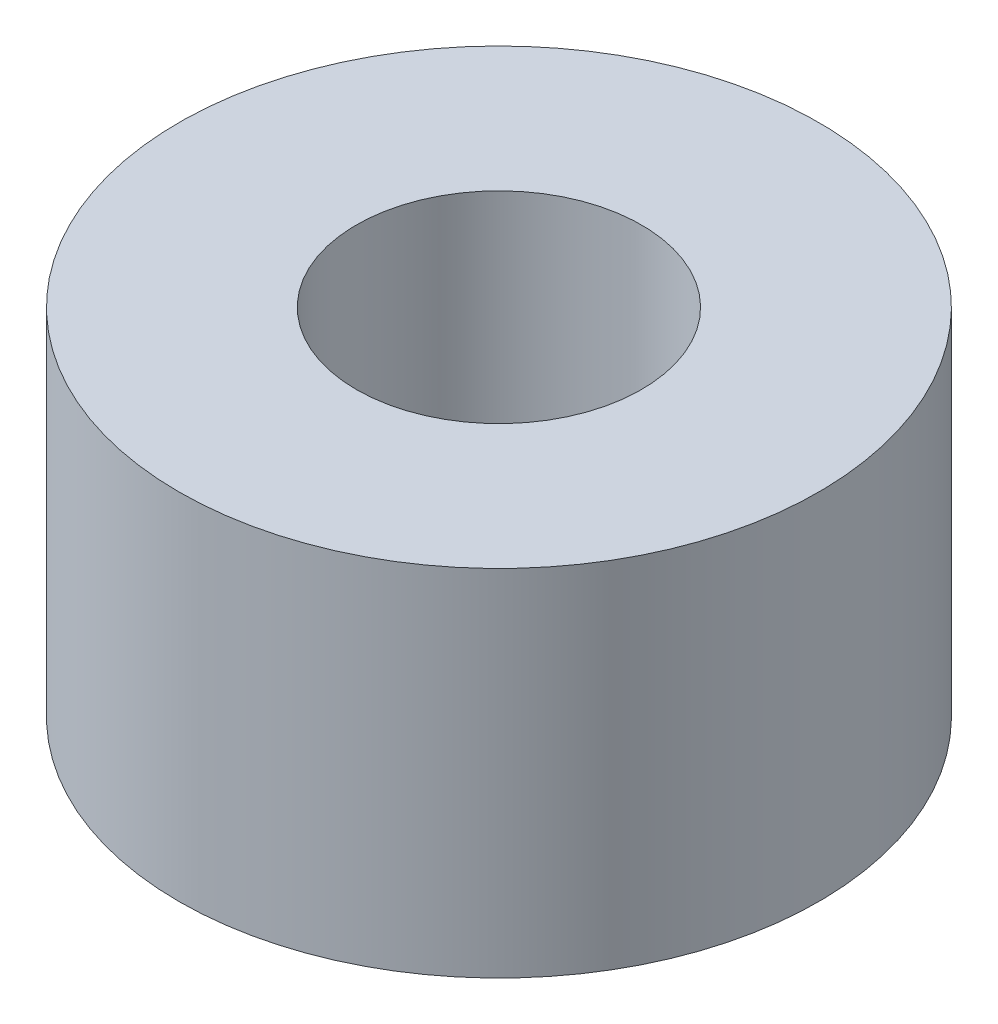
ISO-10303-21;
HEADER;
FILE_DESCRIPTION(('STEP AP214'),'2;1');
FILE_NAME('part.step','',(''),(''),'','','');
FILE_SCHEMA(('AUTOMOTIVE_DESIGN { 1 0 10303 214 1 1 1 1 }'));
ENDSEC;
DATA;
#1=APPLICATION_CONTEXT('core data for automotive mechanical design processes');
#2=APPLICATION_PROTOCOL_DEFINITION('international standard','automotive_design',2000,#1);
#3=PRODUCT_CONTEXT('',#1,'mechanical');
#4=PRODUCT('Part','Part','',(#3));
#5=PRODUCT_RELATED_PRODUCT_CATEGORY('part','',(#4));
#6=PRODUCT_DEFINITION_FORMATION('','',#4);
#7=PRODUCT_DEFINITION_CONTEXT('part definition',#1,'design');
#8=PRODUCT_DEFINITION('design','',#6,#7);
#9=PRODUCT_DEFINITION_SHAPE('','',#8);
#10=(LENGTH_UNIT() NAMED_UNIT(*) SI_UNIT(.MILLI.,.METRE.));
#11=(NAMED_UNIT(*) PLANE_ANGLE_UNIT() SI_UNIT($,.RADIAN.));
#12=(NAMED_UNIT(*) SI_UNIT($,.STERADIAN.) SOLID_ANGLE_UNIT());
#13=UNCERTAINTY_MEASURE_WITH_UNIT(LENGTH_MEASURE(1.E-05),#10,'distance_accuracy_value','');
#14=(GEOMETRIC_REPRESENTATION_CONTEXT(3) GLOBAL_UNCERTAINTY_ASSIGNED_CONTEXT((#13)) GLOBAL_UNIT_ASSIGNED_CONTEXT((#10,
#11,#12)) REPRESENTATION_CONTEXT('',''));
#15=CARTESIAN_POINT('',(0.,0.,0.));
#16=DIRECTION('',(0.,0.,1.));
#17=DIRECTION('',(1.,0.,0.));
#18=AXIS2_PLACEMENT_3D('',#15,#16,#17);
#19=CARTESIAN_POINT('',(0.,6.35,0.));
#20=DIRECTION('',(0.,1.,0.));
#21=DIRECTION('',(0.,0.,1.));
#22=AXIS2_PLACEMENT_3D('',#19,#20,#21);
#23=PLANE('',#22);
#24=CARTESIAN_POINT('',(0.,6.35,0.));
#25=DIRECTION('',(0.,1.,0.));
#26=DIRECTION('',(0.,0.,1.));
#27=AXIS2_PLACEMENT_3D('',#24,#25,#26);
#28=CIRCLE('',#27,5.7277);
#29=CARTESIAN_POINT('',(0.,6.35,5.7277));
#30=VERTEX_POINT('',#29);
#31=EDGE_CURVE('E10',#30,#30,#28,.T.);
#32=ORIENTED_EDGE('',*,*,#31,.T.);
#33=EDGE_LOOP('',(#32));
#34=FACE_BOUND('',#33,.T.);
#35=CARTESIAN_POINT('',(0.,6.35,0.));
#36=DIRECTION('',(0.,1.,0.));
#37=DIRECTION('',(0.,0.,1.));
#38=AXIS2_PLACEMENT_3D('',#35,#36,#37);
#39=CIRCLE('',#38,2.5527);
#40=CARTESIAN_POINT('',(0.,6.35,2.5527));
#41=VERTEX_POINT('',#40);
#42=EDGE_CURVE('E50',#41,#41,#39,.T.);
#43=ORIENTED_EDGE('',*,*,#42,.F.);
#44=EDGE_LOOP('',(#43));
#45=FACE_BOUND('',#44,.T.);
#46=ADVANCED_FACE('F39',(#34,#45),#23,.T.);
#47=CARTESIAN_POINT('',(0.,0.,0.));
#48=DIRECTION('',(0.,1.,0.));
#49=DIRECTION('',(0.,0.,1.));
#50=AXIS2_PLACEMENT_3D('',#47,#48,#49);
#51=PLANE('',#50);
#52=CARTESIAN_POINT('',(0.,0.,0.));
#53=DIRECTION('',(0.,1.,0.));
#54=DIRECTION('',(0.,0.,1.));
#55=AXIS2_PLACEMENT_3D('',#52,#53,#54);
#56=CIRCLE('',#55,5.7277);
#57=CARTESIAN_POINT('',(0.,0.,5.7277));
#58=VERTEX_POINT('',#57);
#59=EDGE_CURVE('E43',#58,#58,#56,.T.);
#60=ORIENTED_EDGE('',*,*,#59,.F.);
#61=EDGE_LOOP('',(#60));
#62=FACE_BOUND('',#61,.T.);
#63=CARTESIAN_POINT('',(0.,0.,0.));
#64=DIRECTION('',(0.,1.,0.));
#65=DIRECTION('',(0.,0.,1.));
#66=AXIS2_PLACEMENT_3D('',#63,#64,#65);
#67=CIRCLE('',#66,2.5527);
#68=CARTESIAN_POINT('',(0.,0.,2.5527));
#69=VERTEX_POINT('',#68);
#70=EDGE_CURVE('E52',#69,#69,#67,.T.);
#71=ORIENTED_EDGE('',*,*,#70,.T.);
#72=EDGE_LOOP('',(#71));
#73=FACE_BOUND('',#72,.T.);
#74=ADVANCED_FACE('F62',(#62,#73),#51,.F.);
#75=CARTESIAN_POINT('',(0.,6.35,0.));
#76=DIRECTION('',(0.,-1.,0.));
#77=DIRECTION('',(0.,0.,-1.));
#78=AXIS2_PLACEMENT_3D('',#75,#76,#77);
#79=CYLINDRICAL_SURFACE('',#78,5.7277);
#80=ORIENTED_EDGE('',*,*,#31,.F.);
#81=EDGE_LOOP('',(#80));
#82=FACE_BOUND('',#81,.T.);
#83=ORIENTED_EDGE('',*,*,#59,.T.);
#84=EDGE_LOOP('',(#83));
#85=FACE_BOUND('',#84,.T.);
#86=ADVANCED_FACE('F41',(#82,#85),#79,.T.);
#87=CARTESIAN_POINT('',(0.,6.35,0.));
#88=DIRECTION('',(0.,-1.,0.));
#89=DIRECTION('',(0.,0.,-1.));
#90=AXIS2_PLACEMENT_3D('',#87,#88,#89);
#91=CYLINDRICAL_SURFACE('',#90,2.5527);
#92=ORIENTED_EDGE('',*,*,#42,.T.);
#93=EDGE_LOOP('',(#92));
#94=FACE_BOUND('',#93,.T.);
#95=ORIENTED_EDGE('',*,*,#70,.F.);
#96=EDGE_LOOP('',(#95));
#97=FACE_BOUND('',#96,.T.);
#98=ADVANCED_FACE('F58',(#94,#97),#91,.F.);
#99=CLOSED_SHELL('',(#46,#74,#86,#98));
#100=MANIFOLD_SOLID_BREP('B2',#99);
#101=ADVANCED_BREP_SHAPE_REPRESENTATION('',(#18,#100),#14);
#102=SHAPE_DEFINITION_REPRESENTATION(#9,#101);
ENDSEC;
END-ISO-10303-21;
